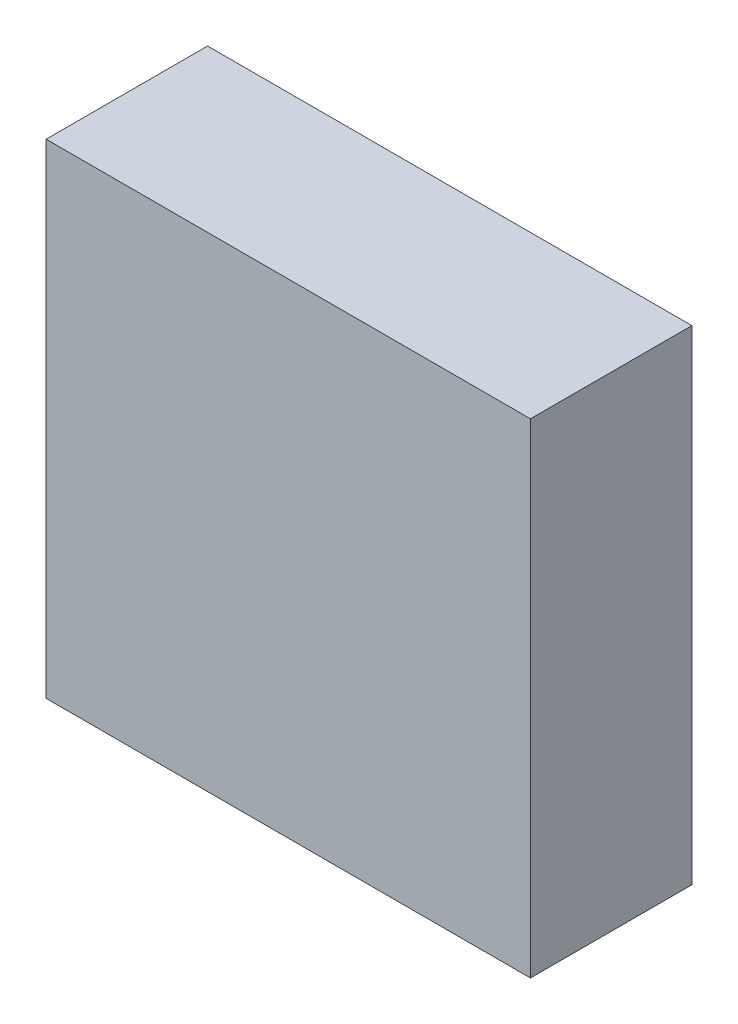
ISO-10303-21;
HEADER;
FILE_DESCRIPTION(('STEP AP214'),'2;1');
FILE_NAME('part.step','',(''),(''),'','','');
FILE_SCHEMA(('AUTOMOTIVE_DESIGN { 1 0 10303 214 1 1 1 1 }'));
ENDSEC;
DATA;
#1=APPLICATION_CONTEXT('core data for automotive mechanical design processes');
#2=APPLICATION_PROTOCOL_DEFINITION('international standard','automotive_design',2000,#1);
#3=PRODUCT_CONTEXT('',#1,'mechanical');
#4=PRODUCT('Part','Part','',(#3));
#5=PRODUCT_RELATED_PRODUCT_CATEGORY('part','',(#4));
#6=PRODUCT_DEFINITION_FORMATION('','',#4);
#7=PRODUCT_DEFINITION_CONTEXT('part definition',#1,'design');
#8=PRODUCT_DEFINITION('design','',#6,#7);
#9=PRODUCT_DEFINITION_SHAPE('','',#8);
#10=(LENGTH_UNIT() NAMED_UNIT(*) SI_UNIT(.MILLI.,.METRE.));
#11=(NAMED_UNIT(*) PLANE_ANGLE_UNIT() SI_UNIT($,.RADIAN.));
#12=(NAMED_UNIT(*) SI_UNIT($,.STERADIAN.) SOLID_ANGLE_UNIT());
#13=UNCERTAINTY_MEASURE_WITH_UNIT(LENGTH_MEASURE(1.E-05),#10,'distance_accuracy_value','');
#14=(GEOMETRIC_REPRESENTATION_CONTEXT(3) GLOBAL_UNCERTAINTY_ASSIGNED_CONTEXT((#13)) GLOBAL_UNIT_ASSIGNED_CONTEXT((#10,
#11,#12)) REPRESENTATION_CONTEXT('',''));
#15=CARTESIAN_POINT('',(0.,0.,0.));
#16=DIRECTION('',(0.,0.,1.));
#17=DIRECTION('',(1.,0.,0.));
#18=AXIS2_PLACEMENT_3D('',#15,#16,#17);
#19=CARTESIAN_POINT('',(2.20901001383227,2.60361515907234,1.6));
#20=DIRECTION('',(-1.,0.,0.));
#21=DIRECTION('',(0.,-1.,0.));
#22=AXIS2_PLACEMENT_3D('',#19,#20,#21);
#23=PLANE('',#22);
#24=DIRECTION('',(0.,1.,0.));
#25=VECTOR('',#24,1.);
#26=CARTESIAN_POINT('',(2.20901001383227,2.60361515907234,0.));
#27=LINE('',#26,#25);
#28=CARTESIAN_POINT('',(2.20901001383229,-2.19638484092766,0.));
#29=VERTEX_POINT('',#28);
#30=CARTESIAN_POINT('',(2.20901001383227,2.60361515907234,0.));
#31=VERTEX_POINT('',#30);
#32=EDGE_CURVE('E96',#29,#31,#27,.T.);
#33=ORIENTED_EDGE('',*,*,#32,.T.);
#34=DIRECTION('',(0.,0.,-1.));
#35=VECTOR('',#34,1.);
#36=CARTESIAN_POINT('',(2.20901001383227,2.60361515907234,1.6));
#37=LINE('',#36,#35);
#38=CARTESIAN_POINT('',(2.20901001383227,2.60361515907234,1.6));
#39=VERTEX_POINT('',#38);
#40=EDGE_CURVE('E11',#39,#31,#37,.T.);
#41=ORIENTED_EDGE('',*,*,#40,.F.);
#42=DIRECTION('',(0.,1.,0.));
#43=VECTOR('',#42,1.);
#44=CARTESIAN_POINT('',(2.20901001383227,2.60361515907234,1.6));
#45=LINE('',#44,#43);
#46=CARTESIAN_POINT('',(2.20901001383229,-2.19638484092766,1.6));
#47=VERTEX_POINT('',#46);
#48=EDGE_CURVE('E84',#47,#39,#45,.T.);
#49=ORIENTED_EDGE('',*,*,#48,.F.);
#50=DIRECTION('',(0.,0.,-1.));
#51=VECTOR('',#50,1.);
#52=CARTESIAN_POINT('',(2.20901001383229,-2.19638484092766,1.6));
#53=LINE('',#52,#51);
#54=EDGE_CURVE('E92',#47,#29,#53,.T.);
#55=ORIENTED_EDGE('',*,*,#54,.T.);
#56=EDGE_LOOP('',(#33,#41,#49,#55));
#57=FACE_BOUND('',#56,.T.);
#58=ADVANCED_FACE('F33',(#57),#23,.F.);
#59=CARTESIAN_POINT('',(-2.59098998616775,2.60361515907234,1.6));
#60=DIRECTION('',(0.,-1.,0.));
#61=DIRECTION('',(0.,0.,-1.));
#62=AXIS2_PLACEMENT_3D('',#59,#60,#61);
#63=PLANE('',#62);
#64=DIRECTION('',(-1.,0.,0.));
#65=VECTOR('',#64,1.);
#66=CARTESIAN_POINT('',(-2.59098998616775,2.60361515907234,0.));
#67=LINE('',#66,#65);
#68=CARTESIAN_POINT('',(-2.59098998616775,2.60361515907234,0.));
#69=VERTEX_POINT('',#68);
#70=EDGE_CURVE('E88',#31,#69,#67,.T.);
#71=ORIENTED_EDGE('',*,*,#70,.T.);
#72=DIRECTION('',(0.,0.,-1.));
#73=VECTOR('',#72,1.);
#74=CARTESIAN_POINT('',(-2.59098998616775,2.60361515907234,1.6));
#75=LINE('',#74,#73);
#76=CARTESIAN_POINT('',(-2.59098998616775,2.60361515907234,1.6));
#77=VERTEX_POINT('',#76);
#78=EDGE_CURVE('E41',#77,#69,#75,.T.);
#79=ORIENTED_EDGE('',*,*,#78,.F.);
#80=DIRECTION('',(-1.,0.,0.));
#81=VECTOR('',#80,1.);
#82=CARTESIAN_POINT('',(-2.59098998616775,2.60361515907234,1.6));
#83=LINE('',#82,#81);
#84=EDGE_CURVE('E79',#39,#77,#83,.T.);
#85=ORIENTED_EDGE('',*,*,#84,.F.);
#86=ORIENTED_EDGE('',*,*,#40,.T.);
#87=EDGE_LOOP('',(#71,#79,#85,#86));
#88=FACE_BOUND('',#87,.T.);
#89=ADVANCED_FACE('F87',(#88),#63,.F.);
#90=CARTESIAN_POINT('',(-2.59098998616775,2.60361515907234,1.6));
#91=DIRECTION('',(1.,0.,0.));
#92=DIRECTION('',(0.,0.,-1.));
#93=AXIS2_PLACEMENT_3D('',#90,#91,#92);
#94=PLANE('',#93);
#95=DIRECTION('',(0.,-1.,0.));
#96=VECTOR('',#95,1.);
#97=CARTESIAN_POINT('',(-2.59098998616775,2.60361515907234,0.));
#98=LINE('',#97,#96);
#99=CARTESIAN_POINT('',(-2.59098998616775,-2.19638484092766,0.));
#100=VERTEX_POINT('',#99);
#101=EDGE_CURVE('E66',#69,#100,#98,.T.);
#102=ORIENTED_EDGE('',*,*,#101,.T.);
#103=DIRECTION('',(0.,0.,-1.));
#104=VECTOR('',#103,1.);
#105=CARTESIAN_POINT('',(-2.59098998616775,-2.19638484092766,1.6));
#106=LINE('',#105,#104);
#107=CARTESIAN_POINT('',(-2.59098998616775,-2.19638484092766,1.6));
#108=VERTEX_POINT('',#107);
#109=EDGE_CURVE('E89',#108,#100,#106,.T.);
#110=ORIENTED_EDGE('',*,*,#109,.F.);
#111=DIRECTION('',(0.,-1.,0.));
#112=VECTOR('',#111,1.);
#113=CARTESIAN_POINT('',(-2.59098998616775,2.60361515907234,1.6));
#114=LINE('',#113,#112);
#115=EDGE_CURVE('E82',#77,#108,#114,.T.);
#116=ORIENTED_EDGE('',*,*,#115,.F.);
#117=ORIENTED_EDGE('',*,*,#78,.T.);
#118=EDGE_LOOP('',(#102,#110,#116,#117));
#119=FACE_BOUND('',#118,.T.);
#120=ADVANCED_FACE('F90',(#119),#94,.F.);
#121=CARTESIAN_POINT('',(-2.59098998616775,-2.19638484092766,1.6));
#122=DIRECTION('',(0.,1.,0.));
#123=DIRECTION('',(0.,0.,1.));
#124=AXIS2_PLACEMENT_3D('',#121,#122,#123);
#125=PLANE('',#124);
#126=DIRECTION('',(1.,0.,0.));
#127=VECTOR('',#126,1.);
#128=CARTESIAN_POINT('',(-2.59098998616775,-2.19638484092766,0.));
#129=LINE('',#128,#127);
#130=EDGE_CURVE('E72',#100,#29,#129,.T.);
#131=ORIENTED_EDGE('',*,*,#130,.T.);
#132=ORIENTED_EDGE('',*,*,#54,.F.);
#133=DIRECTION('',(1.,0.,0.));
#134=VECTOR('',#133,1.);
#135=CARTESIAN_POINT('',(-2.59098998616775,-2.19638484092766,1.6));
#136=LINE('',#135,#134);
#137=EDGE_CURVE('E49',#108,#47,#136,.T.);
#138=ORIENTED_EDGE('',*,*,#137,.F.);
#139=ORIENTED_EDGE('',*,*,#109,.T.);
#140=EDGE_LOOP('',(#131,#132,#138,#139));
#141=FACE_BOUND('',#140,.T.);
#142=ADVANCED_FACE('F103',(#141),#125,.F.);
#143=CARTESIAN_POINT('',(0.,0.,1.6));
#144=DIRECTION('',(0.,0.,1.));
#145=DIRECTION('',(1.,0.,0.));
#146=AXIS2_PLACEMENT_3D('',#143,#144,#145);
#147=PLANE('',#146);
#148=ORIENTED_EDGE('',*,*,#48,.T.);
#149=ORIENTED_EDGE('',*,*,#84,.T.);
#150=ORIENTED_EDGE('',*,*,#115,.T.);
#151=ORIENTED_EDGE('',*,*,#137,.T.);
#152=EDGE_LOOP('',(#148,#149,#150,#151));
#153=FACE_BOUND('',#152,.T.);
#154=ADVANCED_FACE('F80',(#153),#147,.T.);
#155=CARTESIAN_POINT('',(0.,0.,0.));
#156=DIRECTION('',(0.,0.,1.));
#157=DIRECTION('',(1.,0.,0.));
#158=AXIS2_PLACEMENT_3D('',#155,#156,#157);
#159=PLANE('',#158);
#160=ORIENTED_EDGE('',*,*,#32,.F.);
#161=ORIENTED_EDGE('',*,*,#130,.F.);
#162=ORIENTED_EDGE('',*,*,#101,.F.);
#163=ORIENTED_EDGE('',*,*,#70,.F.);
#164=EDGE_LOOP('',(#160,#161,#162,#163));
#165=FACE_BOUND('',#164,.T.);
#166=ADVANCED_FACE('F106',(#165),#159,.F.);
#167=CLOSED_SHELL('',(#58,#89,#120,#142,#154,#166));
#168=MANIFOLD_SOLID_BREP('B2',#167);
#169=ADVANCED_BREP_SHAPE_REPRESENTATION('',(#18,#168),#14);
#170=SHAPE_DEFINITION_REPRESENTATION(#9,#169);
ENDSEC;
END-ISO-10303-21;
